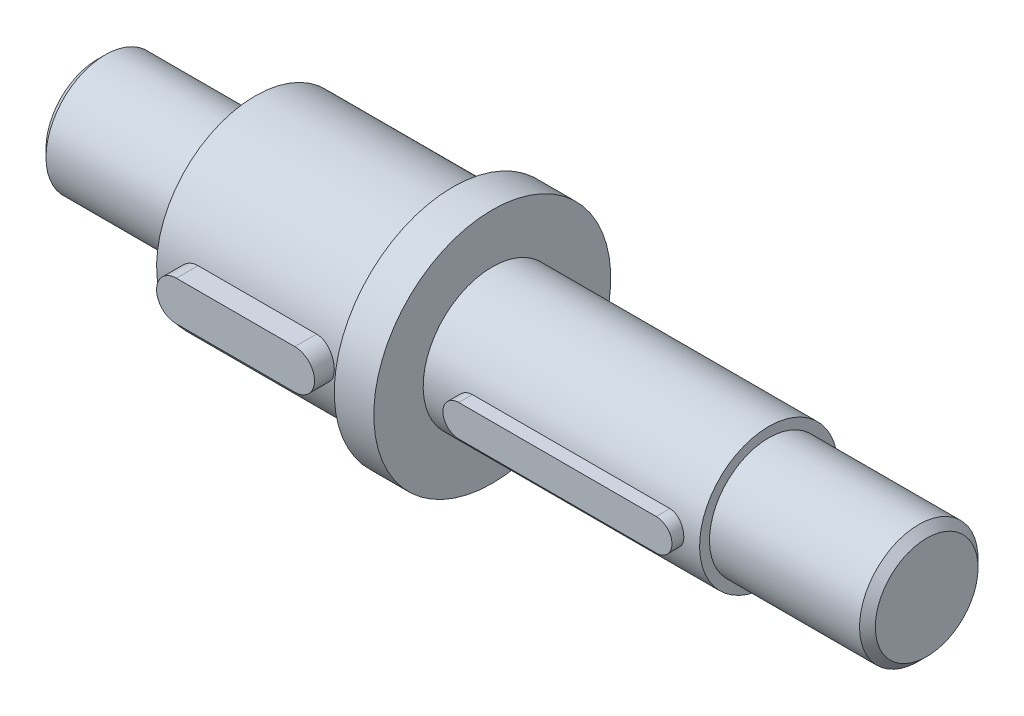
ISO-10303-21;
HEADER;
FILE_DESCRIPTION(('STEP AP214'),'2;1');
FILE_NAME('part.step','',(''),(''),'','','');
FILE_SCHEMA(('AUTOMOTIVE_DESIGN { 1 0 10303 214 1 1 1 1 }'));
ENDSEC;
DATA;
#1=APPLICATION_CONTEXT('core data for automotive mechanical design processes');
#2=APPLICATION_PROTOCOL_DEFINITION('international standard','automotive_design',2000,#1);
#3=PRODUCT_CONTEXT('',#1,'mechanical');
#4=PRODUCT('Part','Part','',(#3));
#5=PRODUCT_RELATED_PRODUCT_CATEGORY('part','',(#4));
#6=PRODUCT_DEFINITION_FORMATION('','',#4);
#7=PRODUCT_DEFINITION_CONTEXT('part definition',#1,'design');
#8=PRODUCT_DEFINITION('design','',#6,#7);
#9=PRODUCT_DEFINITION_SHAPE('','',#8);
#10=(LENGTH_UNIT() NAMED_UNIT(*) SI_UNIT(.MILLI.,.METRE.));
#11=(NAMED_UNIT(*) PLANE_ANGLE_UNIT() SI_UNIT($,.RADIAN.));
#12=(NAMED_UNIT(*) SI_UNIT($,.STERADIAN.) SOLID_ANGLE_UNIT());
#13=UNCERTAINTY_MEASURE_WITH_UNIT(LENGTH_MEASURE(1.E-05),#10,'distance_accuracy_value','');
#14=(GEOMETRIC_REPRESENTATION_CONTEXT(3) GLOBAL_UNCERTAINTY_ASSIGNED_CONTEXT((#13)) GLOBAL_UNIT_ASSIGNED_CONTEXT((#10,
#11,#12)) REPRESENTATION_CONTEXT('',''));
#15=CARTESIAN_POINT('',(0.,0.,0.));
#16=DIRECTION('',(0.,0.,1.));
#17=DIRECTION('',(1.,0.,0.));
#18=AXIS2_PLACEMENT_3D('',#15,#16,#17);
#19=CARTESIAN_POINT('',(112.,0.,20.5));
#20=DIRECTION('',(0.,0.,-1.));
#21=DIRECTION('',(-1.,0.,0.));
#22=AXIS2_PLACEMENT_3D('',#19,#20,#21);
#23=CYLINDRICAL_SURFACE('',#22,4.);
#24=CARTESIAN_POINT('',(112.,0.,14.5));
#25=DIRECTION('',(0.,0.,1.));
#26=DIRECTION('',(1.,0.,0.));
#27=AXIS2_PLACEMENT_3D('',#24,#25,#26);
#28=CIRCLE('',#27,4.);
#29=CARTESIAN_POINT('',(112.,4.,14.5));
#30=VERTEX_POINT('',#29);
#31=CARTESIAN_POINT('',(112.,-4.,14.5));
#32=VERTEX_POINT('',#31);
#33=EDGE_CURVE('E120',#30,#32,#28,.T.);
#34=ORIENTED_EDGE('',*,*,#33,.T.);
#35=DIRECTION('',(0.,0.,-1.));
#36=VECTOR('',#35,1.);
#37=CARTESIAN_POINT('',(112.,-4.,20.5));
#38=LINE('',#37,#36);
#39=CARTESIAN_POINT('',(112.,-4.,20.5));
#40=VERTEX_POINT('',#39);
#41=EDGE_CURVE('E12',#40,#32,#38,.T.);
#42=ORIENTED_EDGE('',*,*,#41,.F.);
#43=CARTESIAN_POINT('',(112.,0.,20.5));
#44=DIRECTION('',(0.,0.,1.));
#45=DIRECTION('',(1.,0.,0.));
#46=AXIS2_PLACEMENT_3D('',#43,#44,#45);
#47=CIRCLE('',#46,4.);
#48=CARTESIAN_POINT('',(112.,4.,20.5));
#49=VERTEX_POINT('',#48);
#50=EDGE_CURVE('E108',#49,#40,#47,.T.);
#51=ORIENTED_EDGE('',*,*,#50,.F.);
#52=DIRECTION('',(0.,0.,-1.));
#53=VECTOR('',#52,1.);
#54=CARTESIAN_POINT('',(112.,4.,20.5));
#55=LINE('',#54,#53);
#56=EDGE_CURVE('E116',#49,#30,#55,.T.);
#57=ORIENTED_EDGE('',*,*,#56,.T.);
#58=EDGE_LOOP('',(#34,#42,#51,#57));
#59=FACE_BOUND('',#58,.T.);
#60=ADVANCED_FACE('F57',(#59),#23,.T.);
#61=CARTESIAN_POINT('',(112.,-4.,20.5));
#62=DIRECTION('',(0.,1.,0.));
#63=DIRECTION('',(0.,0.,1.));
#64=AXIS2_PLACEMENT_3D('',#61,#62,#63);
#65=PLANE('',#64);
#66=DIRECTION('',(1.,0.,0.));
#67=VECTOR('',#66,1.);
#68=CARTESIAN_POINT('',(112.,-4.,14.5));
#69=LINE('',#68,#67);
#70=CARTESIAN_POINT('',(162.,-4.,14.5));
#71=VERTEX_POINT('',#70);
#72=EDGE_CURVE('E112',#32,#71,#69,.T.);
#73=ORIENTED_EDGE('',*,*,#72,.T.);
#74=DIRECTION('',(0.,0.,-1.));
#75=VECTOR('',#74,1.);
#76=CARTESIAN_POINT('',(162.,-4.,20.5));
#77=LINE('',#76,#75);
#78=CARTESIAN_POINT('',(162.,-4.,20.5));
#79=VERTEX_POINT('',#78);
#80=EDGE_CURVE('E65',#79,#71,#77,.T.);
#81=ORIENTED_EDGE('',*,*,#80,.F.);
#82=DIRECTION('',(1.,0.,0.));
#83=VECTOR('',#82,1.);
#84=CARTESIAN_POINT('',(112.,-4.,20.5));
#85=LINE('',#84,#83);
#86=EDGE_CURVE('E103',#40,#79,#85,.T.);
#87=ORIENTED_EDGE('',*,*,#86,.F.);
#88=ORIENTED_EDGE('',*,*,#41,.T.);
#89=EDGE_LOOP('',(#73,#81,#87,#88));
#90=FACE_BOUND('',#89,.T.);
#91=ADVANCED_FACE('F111',(#90),#65,.F.);
#92=CARTESIAN_POINT('',(162.,0.,20.5));
#93=DIRECTION('',(0.,0.,-1.));
#94=DIRECTION('',(-1.,0.,0.));
#95=AXIS2_PLACEMENT_3D('',#92,#93,#94);
#96=CYLINDRICAL_SURFACE('',#95,4.);
#97=CARTESIAN_POINT('',(162.,0.,14.5));
#98=DIRECTION('',(0.,0.,1.));
#99=DIRECTION('',(1.,0.,0.));
#100=AXIS2_PLACEMENT_3D('',#97,#98,#99);
#101=CIRCLE('',#100,4.);
#102=CARTESIAN_POINT('',(162.,4.,14.5));
#103=VERTEX_POINT('',#102);
#104=EDGE_CURVE('E90',#71,#103,#101,.T.);
#105=ORIENTED_EDGE('',*,*,#104,.T.);
#106=DIRECTION('',(0.,0.,-1.));
#107=VECTOR('',#106,1.);
#108=CARTESIAN_POINT('',(162.,4.,20.5));
#109=LINE('',#108,#107);
#110=CARTESIAN_POINT('',(162.,4.,20.5));
#111=VERTEX_POINT('',#110);
#112=EDGE_CURVE('E113',#111,#103,#109,.T.);
#113=ORIENTED_EDGE('',*,*,#112,.F.);
#114=CARTESIAN_POINT('',(162.,0.,20.5));
#115=DIRECTION('',(0.,0.,1.));
#116=DIRECTION('',(1.,0.,0.));
#117=AXIS2_PLACEMENT_3D('',#114,#115,#116);
#118=CIRCLE('',#117,4.);
#119=EDGE_CURVE('E106',#79,#111,#118,.T.);
#120=ORIENTED_EDGE('',*,*,#119,.F.);
#121=ORIENTED_EDGE('',*,*,#80,.T.);
#122=EDGE_LOOP('',(#105,#113,#120,#121));
#123=FACE_BOUND('',#122,.T.);
#124=ADVANCED_FACE('F114',(#123),#96,.T.);
#125=CARTESIAN_POINT('',(162.,4.,20.5));
#126=DIRECTION('',(0.,-1.,0.));
#127=DIRECTION('',(0.,0.,-1.));
#128=AXIS2_PLACEMENT_3D('',#125,#126,#127);
#129=PLANE('',#128);
#130=DIRECTION('',(-1.,0.,0.));
#131=VECTOR('',#130,1.);
#132=CARTESIAN_POINT('',(162.,4.,14.5));
#133=LINE('',#132,#131);
#134=EDGE_CURVE('E96',#103,#30,#133,.T.);
#135=ORIENTED_EDGE('',*,*,#134,.T.);
#136=ORIENTED_EDGE('',*,*,#56,.F.);
#137=DIRECTION('',(-1.,0.,0.));
#138=VECTOR('',#137,1.);
#139=CARTESIAN_POINT('',(162.,4.,20.5));
#140=LINE('',#139,#138);
#141=EDGE_CURVE('E73',#111,#49,#140,.T.);
#142=ORIENTED_EDGE('',*,*,#141,.F.);
#143=ORIENTED_EDGE('',*,*,#112,.T.);
#144=EDGE_LOOP('',(#135,#136,#142,#143));
#145=FACE_BOUND('',#144,.T.);
#146=ADVANCED_FACE('F127',(#145),#129,.F.);
#147=CARTESIAN_POINT('',(112.,0.,20.5));
#148=DIRECTION('',(0.,0.,1.));
#149=DIRECTION('',(1.,0.,0.));
#150=AXIS2_PLACEMENT_3D('',#147,#148,#149);
#151=PLANE('',#150);
#152=ORIENTED_EDGE('',*,*,#50,.T.);
#153=ORIENTED_EDGE('',*,*,#86,.T.);
#154=ORIENTED_EDGE('',*,*,#119,.T.);
#155=ORIENTED_EDGE('',*,*,#141,.T.);
#156=EDGE_LOOP('',(#152,#153,#154,#155));
#157=FACE_BOUND('',#156,.T.);
#158=ADVANCED_FACE('F104',(#157),#151,.T.);
#159=CARTESIAN_POINT('',(112.,0.,14.5));
#160=DIRECTION('',(0.,0.,1.));
#161=DIRECTION('',(1.,0.,0.));
#162=AXIS2_PLACEMENT_3D('',#159,#160,#161);
#163=PLANE('',#162);
#164=ORIENTED_EDGE('',*,*,#33,.F.);
#165=ORIENTED_EDGE('',*,*,#134,.F.);
#166=ORIENTED_EDGE('',*,*,#104,.F.);
#167=ORIENTED_EDGE('',*,*,#72,.F.);
#168=EDGE_LOOP('',(#164,#165,#166,#167));
#169=FACE_BOUND('',#168,.T.);
#170=ADVANCED_FACE('F130',(#169),#163,.F.);
#171=CLOSED_SHELL('',(#60,#91,#124,#146,#158,#170));
#172=MANIFOLD_SOLID_BREP('B2',#171);
#173=CARTESIAN_POINT('',(0.,0.,0.));
#174=DIRECTION('',(-1.,0.,0.));
#175=DIRECTION('',(0.,-1.,0.));
#176=AXIS2_PLACEMENT_3D('',#173,#174,#175);
#177=PLANE('',#176);
#178=CARTESIAN_POINT('',(0.,0.,0.));
#179=DIRECTION('',(-1.,0.,0.));
#180=DIRECTION('',(0.,-1.,0.));
#181=AXIS2_PLACEMENT_3D('',#178,#179,#180);
#182=CIRCLE('',#181,13.);
#183=CARTESIAN_POINT('',(0.,-13.,0.));
#184=VERTEX_POINT('',#183);
#185=EDGE_CURVE('E358',#184,#184,#182,.T.);
#186=ORIENTED_EDGE('',*,*,#185,.T.);
#187=EDGE_LOOP('',(#186));
#188=FACE_BOUND('',#187,.T.);
#189=ADVANCED_FACE('F193',(#188),#177,.T.);
#190=CARTESIAN_POINT('',(210.,0.,0.));
#191=DIRECTION('',(1.,0.,0.));
#192=DIRECTION('',(0.,1.,0.));
#193=AXIS2_PLACEMENT_3D('',#190,#191,#192);
#194=CYLINDRICAL_SURFACE('',#193,15.);
#195=CARTESIAN_POINT('',(1.99999999999997,0.,0.));
#196=DIRECTION('',(-1.,0.,0.));
#197=DIRECTION('',(0.,-1.,0.));
#198=AXIS2_PLACEMENT_3D('',#195,#196,#197);
#199=CIRCLE('',#198,15.);
#200=CARTESIAN_POINT('',(1.99999999999997,-15.,0.));
#201=VERTEX_POINT('',#200);
#202=EDGE_CURVE('E354',#201,#201,#199,.F.);
#203=ORIENTED_EDGE('',*,*,#202,.T.);
#204=EDGE_LOOP('',(#203));
#205=FACE_BOUND('',#204,.T.);
#206=CARTESIAN_POINT('',(40.,0.,0.));
#207=DIRECTION('',(1.,0.,0.));
#208=DIRECTION('',(0.,1.,0.));
#209=AXIS2_PLACEMENT_3D('',#206,#207,#208);
#210=CIRCLE('',#209,15.);
#211=CARTESIAN_POINT('',(40.,15.,0.));
#212=VERTEX_POINT('',#211);
#213=EDGE_CURVE('E350',#212,#212,#210,.T.);
#214=ORIENTED_EDGE('',*,*,#213,.F.);
#215=EDGE_LOOP('',(#214));
#216=FACE_BOUND('',#215,.T.);
#217=ADVANCED_FACE('F464',(#205,#216),#194,.T.);
#218=CARTESIAN_POINT('',(40.,15.,0.));
#219=DIRECTION('',(-1.,0.,0.));
#220=DIRECTION('',(0.,-1.,0.));
#221=AXIS2_PLACEMENT_3D('',#218,#219,#220);
#222=PLANE('',#221);
#223=ORIENTED_EDGE('',*,*,#213,.T.);
#224=EDGE_LOOP('',(#223));
#225=FACE_BOUND('',#224,.T.);
#226=CARTESIAN_POINT('',(40.,0.,0.));
#227=DIRECTION('',(1.,0.,0.));
#228=DIRECTION('',(0.,1.,0.));
#229=AXIS2_PLACEMENT_3D('',#226,#227,#228);
#230=CIRCLE('',#229,25.);
#231=CARTESIAN_POINT('',(40.,25.,0.));
#232=VERTEX_POINT('',#231);
#233=EDGE_CURVE('E346',#232,#232,#230,.T.);
#234=ORIENTED_EDGE('',*,*,#233,.F.);
#235=EDGE_LOOP('',(#234));
#236=FACE_BOUND('',#235,.T.);
#237=ADVANCED_FACE('F470',(#225,#236),#222,.T.);
#238=CARTESIAN_POINT('',(210.,0.,0.));
#239=DIRECTION('',(1.,0.,0.));
#240=DIRECTION('',(0.,1.,0.));
#241=AXIS2_PLACEMENT_3D('',#238,#239,#240);
#242=CYLINDRICAL_SURFACE('',#241,25.);
#243=CARTESIAN_POINT('',(80.,-4.99999999999999,24.4948974278318));
#244=CARTESIAN_POINT('',(80.1391253266414,-5.00001666827264,24.4948849644864));
#245=CARTESIAN_POINT('',(80.2782463400245,-4.99419397242176,24.4960823045703));
#246=CARTESIAN_POINT('',(80.5554648435272,-4.97099170943313,24.50080611049));
#247=CARTESIAN_POINT('',(80.6935624581255,-4.95361357194362,24.5043322881998));
#248=CARTESIAN_POINT('',(80.9675458103971,-4.90745732970079,24.513616269194));
#249=CARTESIAN_POINT('',(81.1034345908507,-4.87869659169541,24.5193706725256));
#250=CARTESIAN_POINT('',(81.3722534051872,-4.81000656952587,24.5329384582686));
#251=CARTESIAN_POINT('',(81.5051834269892,-4.77007723976851,24.5407518490854));
#252=CARTESIAN_POINT('',(81.7671454567224,-4.67935997504847,24.5582108316482));
#253=CARTESIAN_POINT('',(81.8961778299596,-4.62857306133625,24.5678562510663));
#254=CARTESIAN_POINT('',(82.1495228220018,-4.5164969896502,24.5887068281803));
#255=CARTESIAN_POINT('',(82.2738336734668,-4.45520394548309,24.5999125627442));
#256=CARTESIAN_POINT('',(82.5168156612067,-4.32259070656746,24.6235607101597));
#257=CARTESIAN_POINT('',(82.6354883905463,-4.25127336702452,24.6360027705756));
#258=CARTESIAN_POINT('',(82.86648984474,-4.09907006911225,24.6617838379427));
#259=CARTESIAN_POINT('',(82.9788161769435,-4.01818053703546,24.6751231790797));
#260=CARTESIAN_POINT('',(83.1976679526694,-3.84636310105368,24.7024927456793));
#261=CARTESIAN_POINT('',(83.3041059155987,-3.75532477701367,24.7165294141223));
#262=CARTESIAN_POINT('',(83.5090005646721,-3.56461921808491,24.7447526144403));
#263=CARTESIAN_POINT('',(83.6074542781927,-3.46494879767303,24.7589391999292));
#264=CARTESIAN_POINT('',(83.7956503618845,-3.25770259068246,24.7870592087541));
#265=CARTESIAN_POINT('',(83.8853945639721,-3.15012847492922,24.8009926848246));
#266=CARTESIAN_POINT('',(84.0556088733399,-2.92773828992183,24.8282278973015));
#267=CARTESIAN_POINT('',(84.1360755503133,-2.81291956614297,24.8415293989775));
#268=CARTESIAN_POINT('',(84.2877613382002,-2.57586261860518,24.8672326807152));
#269=CARTESIAN_POINT('',(84.3588975606977,-2.45357041583781,24.8796260142365));
#270=CARTESIAN_POINT('',(84.4906250198366,-2.20324717771264,24.9030421535278));
#271=CARTESIAN_POINT('',(84.5512123017208,-2.07521401261381,24.9140644448591));
#272=CARTESIAN_POINT('',(84.6613208436174,-1.81441746775922,24.9344136360483));
#273=CARTESIAN_POINT('',(84.7108475984345,-1.68165647494044,24.9437413773172));
#274=CARTESIAN_POINT('',(84.7985020176939,-1.41225203764252,24.9604441197165));
#275=CARTESIAN_POINT('',(84.8366255558689,-1.27560720732983,24.9678184138796));
#276=CARTESIAN_POINT('',(84.9007026495545,-1.0013301067078,24.9803102866208));
#277=CARTESIAN_POINT('',(84.9268137751062,-0.863736164157331,24.9854570281343));
#278=CARTESIAN_POINT('',(84.9674264931271,-0.586784276733812,24.9934984482444));
#279=CARTESIAN_POINT('',(84.9819240548557,-0.447425736450269,24.9963923449322));
#280=CARTESIAN_POINT('',(85.007722093994,-0.028233914543985,25.0015345303172));
#281=CARTESIAN_POINT('',(85.0014024880644,0.253035346754799,25.0002582152219));
#282=CARTESIAN_POINT('',(84.9570342009316,0.668581641108652,24.9914408151569));
#283=CARTESIAN_POINT('',(84.9366814465339,0.805138662755828,24.9874010387134));
#284=CARTESIAN_POINT('',(84.8847845695753,1.07603260238649,24.9771983765684));
#285=CARTESIAN_POINT('',(84.8532443393329,1.21037027552905,24.9710362292986));
#286=CARTESIAN_POINT('',(84.7791934341752,1.47591760067315,24.9567501974578));
#287=CARTESIAN_POINT('',(84.7366787586714,1.60712609287945,24.9486255975703));
#288=CARTESIAN_POINT('',(84.6410233920703,1.8654381437386,24.9306416146559));
#289=CARTESIAN_POINT('',(84.5878863834583,1.99254310728992,24.9207828329663));
#290=CARTESIAN_POINT('',(84.4709762706757,2.2426674277943,24.899524196117));
#291=CARTESIAN_POINT('',(84.4071346269613,2.36565390182105,24.8881145061704));
#292=CARTESIAN_POINT('',(84.2695501862382,2.6057785531881,24.8641202109373));
#293=CARTESIAN_POINT('',(84.1958108496162,2.72291875492853,24.851536016742));
#294=CARTESIAN_POINT('',(84.0388948841914,2.95067106820489,24.8255248721503));
#295=CARTESIAN_POINT('',(83.9557142996826,3.06128041370931,24.8120975695679));
#296=CARTESIAN_POINT('',(83.7805378509762,3.27515412500652,24.7847732726215));
#297=CARTESIAN_POINT('',(83.6885450703313,3.3784210381766,24.7708764436475));
#298=CARTESIAN_POINT('',(83.4946284635822,3.57873527346884,24.7427376365477));
#299=CARTESIAN_POINT('',(83.3925576496267,3.67564011377472,24.7284939036525));
#300=CARTESIAN_POINT('',(83.1806275854925,3.86048859181167,24.7003111004447));
#301=CARTESIAN_POINT('',(83.0707711471919,3.94843543715,24.6863719224938));
#302=CARTESIAN_POINT('',(82.843906189763,4.11485123813351,24.6591791231742));
#303=CARTESIAN_POINT('',(82.7268930120297,4.19331391911306,24.6459259589468));
#304=CARTESIAN_POINT('',(82.4866232792524,4.34010555279845,24.6205002572596));
#305=CARTESIAN_POINT('',(82.3633691261763,4.40843836501602,24.6083273089475));
#306=CARTESIAN_POINT('',(82.1110335271011,4.53469984736732,24.5853743099635));
#307=CARTESIAN_POINT('',(81.981935173049,4.59259554826929,24.5745987023543));
#308=CARTESIAN_POINT('',(81.719229383387,4.69725810665846,24.5548081643222));
#309=CARTESIAN_POINT('',(81.5856237328049,4.74402931205847,24.5457925462705));
#310=CARTESIAN_POINT('',(81.3149597529441,4.82606031456236,24.5297959324801));
#311=CARTESIAN_POINT('',(81.1779051839507,4.86133210938725,24.5228128169847));
#312=CARTESIAN_POINT('',(80.9012624710491,4.92013311165956,24.5110829912476));
#313=CARTESIAN_POINT('',(80.7616755648169,4.943667903404,24.5063352175227));
#314=CARTESIAN_POINT('',(80.5182407981625,4.97415554156175,24.5001622999759));
#315=CARTESIAN_POINT('',(80.4147417318496,4.9838517075934,24.498189711568));
#316=CARTESIAN_POINT('',(80.2074982694361,4.99677038633665,24.4955566519276));
#317=CARTESIAN_POINT('',(80.1037545762686,5.00000373289603,24.4948939848492));
#318=CARTESIAN_POINT('',(80.,5.00000000000001,24.4948974278318));
#319=B_SPLINE_CURVE_WITH_KNOTS('',3,(#243,#244,#245,#246,#247,#248,#249,#250,#251,#252,#253,
#254,#255,#256,#257,#258,#259,#260,#261,#262,#263,#264,#265,#266,#267,#268,#269,#270,#271,#272,
#273,#274,#275,#276,#277,#278,#279,#280,#281,#282,#283,#284,#285,#286,#287,#288,#289,#290,#291,
#292,#293,#294,#295,#296,#297,#298,#299,#300,#301,#302,#303,#304,#305,#306,#307,#308,#309,#310,
#311,#312,#313,#314,#315,#316,#317,#318),.UNSPECIFIED.,.F.,.F.,(4,2,2,2,2,2,2,2,2,2,2,2,2,2,2,2,
2,2,2,2,2,2,2,2,2,2,2,2,2,2,2,2,2,2,2,2,2,4),(0.,0.417242551789585,0.834433491607664,
1.25099035047395,1.6675489098622,2.08406830550986,2.50074210451559,2.91729746251713,
3.33400883196915,3.75580364592259,4.17775478454161,4.59961697876816,5.02163465704724,
5.44717860948246,5.87288175479562,6.29837294048706,6.72401790492143,7.14390813062633,
7.56394402533168,8.40304192223055,8.81705081972049,9.2309158173335,9.64493189752779,
10.0588046972975,10.4754363941303,10.8919228076445,11.3085843698369,11.7251006632377,
12.1489910901878,12.5727291962766,12.9967461280637,13.4206010905545,13.8457723408149,
14.2707771424992,14.6953370927157,15.1196948502476,15.4314077968161,15.7425977684821),.UNSPECIFIED.);
#320=CARTESIAN_POINT('',(80.,-4.99999999999999,24.4948974278318));
#321=VERTEX_POINT('',#320);
#322=CARTESIAN_POINT('',(80.,5.00000000000001,24.4948974278318));
#323=VERTEX_POINT('',#322);
#324=EDGE_CURVE('E413',#321,#323,#319,.T.);
#325=ORIENTED_EDGE('',*,*,#324,.F.);
#326=DIRECTION('',(1.,0.,0.));
#327=VECTOR('',#326,1.);
#328=CARTESIAN_POINT('',(210.,-4.99999999999999,24.4948974278318));
#329=LINE('',#328,#327);
#330=CARTESIAN_POINT('',(50.,-5.,24.4948974278318));
#331=VERTEX_POINT('',#330);
#332=EDGE_CURVE('E55',#331,#321,#329,.T.);
#333=ORIENTED_EDGE('',*,*,#332,.F.);
#334=CARTESIAN_POINT('',(50.,5.,24.4948974278318));
#335=CARTESIAN_POINT('',(49.8608746733586,5.00001666827265,24.4948849644864));
#336=CARTESIAN_POINT('',(49.7217536599755,4.99419397242177,24.4960823045703));
#337=CARTESIAN_POINT('',(49.4445351564728,4.97099170943313,24.50080611049));
#338=CARTESIAN_POINT('',(49.3064375418745,4.95361357194363,24.5043322881998));
#339=CARTESIAN_POINT('',(49.032454189603,4.9074573297008,24.513616269194));
#340=CARTESIAN_POINT('',(48.8965654091493,4.87869659169542,24.5193706725256));
#341=CARTESIAN_POINT('',(48.6277465948128,4.81000656952587,24.5329384582686));
#342=CARTESIAN_POINT('',(48.4948165730109,4.77007723976852,24.5407518490854));
#343=CARTESIAN_POINT('',(48.2328545432777,4.67935997504848,24.5582108316482));
#344=CARTESIAN_POINT('',(48.1038221700404,4.62857306133625,24.5678562510663));
#345=CARTESIAN_POINT('',(47.8504771779982,4.5164969896502,24.5887068281803));
#346=CARTESIAN_POINT('',(47.7261663265332,4.45520394548308,24.5999125627442));
#347=CARTESIAN_POINT('',(47.4831843387933,4.32259070656745,24.6235607101597));
#348=CARTESIAN_POINT('',(47.3645116094537,4.25127336702451,24.6360027705756));
#349=CARTESIAN_POINT('',(47.13351015526,4.09907006911224,24.6617838379427));
#350=CARTESIAN_POINT('',(47.0211838230565,4.01818053703546,24.6751231790797));
#351=CARTESIAN_POINT('',(46.8023320473307,3.84636310105368,24.7024927456793));
#352=CARTESIAN_POINT('',(46.6958940844013,3.75532477701366,24.7165294141223));
#353=CARTESIAN_POINT('',(46.490999435328,3.56461921808491,24.7447526144403));
#354=CARTESIAN_POINT('',(46.3925457218073,3.46494879767303,24.7589391999292));
#355=CARTESIAN_POINT('',(46.2043496381155,3.25770259068246,24.7870592087541));
#356=CARTESIAN_POINT('',(46.1146054360279,3.15012847492922,24.8009926848246));
#357=CARTESIAN_POINT('',(45.9443911266601,2.92773828992183,24.8282278973015));
#358=CARTESIAN_POINT('',(45.8639244496867,2.81291956614297,24.8415293989775));
#359=CARTESIAN_POINT('',(45.7122386617998,2.57586261860519,24.8672326807152));
#360=CARTESIAN_POINT('',(45.6411024393023,2.45357041583781,24.8796260142365));
#361=CARTESIAN_POINT('',(45.5093749801634,2.20324717771265,24.9030421535278));
#362=CARTESIAN_POINT('',(45.4487876982792,2.07521401261382,24.9140644448591));
#363=CARTESIAN_POINT('',(45.3386791563826,1.81441746775922,24.9344136360483));
#364=CARTESIAN_POINT('',(45.2891524015655,1.68165647494044,24.9437413773172));
#365=CARTESIAN_POINT('',(45.2014979823061,1.41225203764252,24.9604441197165));
#366=CARTESIAN_POINT('',(45.1633744441311,1.27560720732983,24.9678184138796));
#367=CARTESIAN_POINT('',(45.0992973504456,1.00133010670781,24.9803102866208));
#368=CARTESIAN_POINT('',(45.0731862248939,0.86373616415734,24.9854570281343));
#369=CARTESIAN_POINT('',(45.0325735068729,0.586784276733818,24.9934984482444));
#370=CARTESIAN_POINT('',(45.0180759451443,0.447425736450275,24.9963923449322));
#371=CARTESIAN_POINT('',(44.992277906006,0.0282339145439889,25.0015345303172));
#372=CARTESIAN_POINT('',(44.9985975119357,-0.253035346754796,25.0002582152219));
#373=CARTESIAN_POINT('',(45.0429657990685,-0.668581641108654,24.9914408151569));
#374=CARTESIAN_POINT('',(45.0633185534662,-0.805138662755831,24.9874010387134));
#375=CARTESIAN_POINT('',(45.1152154304247,-1.0760326023865,24.9771983765684));
#376=CARTESIAN_POINT('',(45.1467556606671,-1.21037027552906,24.9710362292986));
#377=CARTESIAN_POINT('',(45.2208065658248,-1.47591760067315,24.9567501974578));
#378=CARTESIAN_POINT('',(45.2633212413286,-1.60712609287945,24.9486255975703));
#379=CARTESIAN_POINT('',(45.3589766079297,-1.86543814373861,24.9306416146559));
#380=CARTESIAN_POINT('',(45.4121136165417,-1.99254310728992,24.9207828329663));
#381=CARTESIAN_POINT('',(45.5290237293243,-2.2426674277943,24.899524196117));
#382=CARTESIAN_POINT('',(45.5928653730387,-2.36565390182104,24.8881145061704));
#383=CARTESIAN_POINT('',(45.7304498137618,-2.60577855318809,24.8641202109373));
#384=CARTESIAN_POINT('',(45.8041891503839,-2.72291875492852,24.851536016742));
#385=CARTESIAN_POINT('',(45.9611051158086,-2.95067106820487,24.8255248721503));
#386=CARTESIAN_POINT('',(46.0442857003174,-3.06128041370929,24.8120975695679));
#387=CARTESIAN_POINT('',(46.2194621490239,-3.27515412500651,24.7847732726215));
#388=CARTESIAN_POINT('',(46.3114549296687,-3.37842103817659,24.7708764436475));
#389=CARTESIAN_POINT('',(46.5053715364178,-3.57873527346883,24.7427376365477));
#390=CARTESIAN_POINT('',(46.6074423503734,-3.67564011377471,24.7284939036525));
#391=CARTESIAN_POINT('',(46.8193724145075,-3.86048859181167,24.7003111004447));
#392=CARTESIAN_POINT('',(46.9292288528081,-3.94843543714999,24.6863719224938));
#393=CARTESIAN_POINT('',(47.156093810237,-4.1148512381335,24.6591791231742));
#394=CARTESIAN_POINT('',(47.2731069879703,-4.19331391911305,24.6459259589468));
#395=CARTESIAN_POINT('',(47.5133767207477,-4.34010555279843,24.6205002572596));
#396=CARTESIAN_POINT('',(47.6366308738237,-4.40843836501602,24.6083273089475));
#397=CARTESIAN_POINT('',(47.888966472899,-4.53469984736732,24.5853743099635));
#398=CARTESIAN_POINT('',(48.018064826951,-4.59259554826928,24.5745987023543));
#399=CARTESIAN_POINT('',(48.280770616613,-4.69725810665845,24.5548081643222));
#400=CARTESIAN_POINT('',(48.4143762671951,-4.74402931205847,24.5457925462705));
#401=CARTESIAN_POINT('',(48.6850402470559,-4.82606031456236,24.5297959324801));
#402=CARTESIAN_POINT('',(48.8220948160494,-4.86133210938725,24.5228128169847));
#403=CARTESIAN_POINT('',(49.0987375289509,-4.92013311165956,24.5110829912476));
#404=CARTESIAN_POINT('',(49.2383244351832,-4.94366790340399,24.5063352175227));
#405=CARTESIAN_POINT('',(49.4817592018376,-4.97415554156174,24.500162299976));
#406=CARTESIAN_POINT('',(49.5852582681504,-4.98385170759339,24.498189711568));
#407=CARTESIAN_POINT('',(49.7925017305639,-4.99677038633664,24.4955566519276));
#408=CARTESIAN_POINT('',(49.8962454237314,-5.00000373289602,24.4948939848492));
#409=CARTESIAN_POINT('',(50.,-5.,24.4948974278318));
#410=B_SPLINE_CURVE_WITH_KNOTS('',3,(#334,#335,#336,#337,#338,#339,#340,#341,#342,#343,#344,
#345,#346,#347,#348,#349,#350,#351,#352,#353,#354,#355,#356,#357,#358,#359,#360,#361,#362,#363,
#364,#365,#366,#367,#368,#369,#370,#371,#372,#373,#374,#375,#376,#377,#378,#379,#380,#381,#382,
#383,#384,#385,#386,#387,#388,#389,#390,#391,#392,#393,#394,#395,#396,#397,#398,#399,#400,#401,
#402,#403,#404,#405,#406,#407,#408,#409),.UNSPECIFIED.,.F.,.F.,(4,2,2,2,2,2,2,2,2,2,2,2,2,2,2,2,
2,2,2,2,2,2,2,2,2,2,2,2,2,2,2,2,2,2,2,2,2,4),(0.,0.417242551789599,0.834433491607671,
1.25099035047396,1.66754890986221,2.08406830550986,2.50074210451562,2.91729746251716,
3.33400883196916,3.75580364592261,4.17775478454161,4.59961697876817,5.02163465704724,
5.44717860948246,5.87288175479562,6.29837294048707,6.72401790492142,7.14390813062632,
7.56394402533168,8.40304192223056,8.8170508197205,9.23091581733351,9.6449318975278,
10.0588046972975,10.4754363941303,10.8919228076445,11.3085843698369,11.7251006632377,
12.1489910901879,12.5727291962766,12.9967461280637,13.4206010905545,13.8457723408149,
14.2707771424992,14.6953370927157,15.1196948502477,15.4314077968161,15.7425977684821),.UNSPECIFIED.);
#411=CARTESIAN_POINT('',(50.,5.,24.4948974278318));
#412=VERTEX_POINT('',#411);
#413=EDGE_CURVE('E203',#412,#331,#410,.T.);
#414=ORIENTED_EDGE('',*,*,#413,.F.);
#415=DIRECTION('',(1.,0.,0.));
#416=VECTOR('',#415,1.);
#417=CARTESIAN_POINT('',(210.,5.00000000000001,24.4948974278318));
#418=LINE('',#417,#416);
#419=EDGE_CURVE('E423',#412,#323,#418,.T.);
#420=ORIENTED_EDGE('',*,*,#419,.T.);
#421=EDGE_LOOP('',(#325,#333,#414,#420));
#422=FACE_BOUND('',#421,.T.);
#423=ORIENTED_EDGE('',*,*,#233,.T.);
#424=EDGE_LOOP('',(#423));
#425=FACE_BOUND('',#424,.T.);
#426=CARTESIAN_POINT('',(90.,0.,0.));
#427=DIRECTION('',(1.,0.,0.));
#428=DIRECTION('',(0.,1.,0.));
#429=AXIS2_PLACEMENT_3D('',#426,#427,#428);
#430=CIRCLE('',#429,25.);
#431=CARTESIAN_POINT('',(90.,25.,0.));
#432=VERTEX_POINT('',#431);
#433=EDGE_CURVE('E342',#432,#432,#430,.T.);
#434=ORIENTED_EDGE('',*,*,#433,.F.);
#435=EDGE_LOOP('',(#434));
#436=FACE_BOUND('',#435,.T.);
#437=ADVANCED_FACE('F424',(#422,#425,#436),#242,.T.);
#438=CARTESIAN_POINT('',(90.,25.,0.));
#439=DIRECTION('',(-1.,0.,0.));
#440=DIRECTION('',(0.,-1.,0.));
#441=AXIS2_PLACEMENT_3D('',#438,#439,#440);
#442=PLANE('',#441);
#443=ORIENTED_EDGE('',*,*,#433,.T.);
#444=EDGE_LOOP('',(#443));
#445=FACE_BOUND('',#444,.T.);
#446=CARTESIAN_POINT('',(90.,0.,0.));
#447=DIRECTION('',(1.,0.,0.));
#448=DIRECTION('',(0.,1.,0.));
#449=AXIS2_PLACEMENT_3D('',#446,#447,#448);
#450=CIRCLE('',#449,30.);
#451=CARTESIAN_POINT('',(90.,30.,0.));
#452=VERTEX_POINT('',#451);
#453=EDGE_CURVE('E338',#452,#452,#450,.T.);
#454=ORIENTED_EDGE('',*,*,#453,.F.);
#455=EDGE_LOOP('',(#454));
#456=FACE_BOUND('',#455,.T.);
#457=ADVANCED_FACE('F497',(#445,#456),#442,.T.);
#458=CARTESIAN_POINT('',(210.,0.,0.));
#459=DIRECTION('',(1.,0.,0.));
#460=DIRECTION('',(0.,1.,0.));
#461=AXIS2_PLACEMENT_3D('',#458,#459,#460);
#462=CYLINDRICAL_SURFACE('',#461,30.);
#463=ORIENTED_EDGE('',*,*,#453,.T.);
#464=EDGE_LOOP('',(#463));
#465=FACE_BOUND('',#464,.T.);
#466=CARTESIAN_POINT('',(100.,0.,0.));
#467=DIRECTION('',(1.,0.,0.));
#468=DIRECTION('',(0.,1.,0.));
#469=AXIS2_PLACEMENT_3D('',#466,#467,#468);
#470=CIRCLE('',#469,30.);
#471=CARTESIAN_POINT('',(100.,30.,0.));
#472=VERTEX_POINT('',#471);
#473=EDGE_CURVE('E334',#472,#472,#470,.T.);
#474=ORIENTED_EDGE('',*,*,#473,.F.);
#475=EDGE_LOOP('',(#474));
#476=FACE_BOUND('',#475,.T.);
#477=ADVANCED_FACE('F502',(#465,#476),#462,.T.);
#478=CARTESIAN_POINT('',(100.,30.,0.));
#479=DIRECTION('',(1.,0.,0.));
#480=DIRECTION('',(0.,1.,0.));
#481=AXIS2_PLACEMENT_3D('',#478,#479,#480);
#482=PLANE('',#481);
#483=ORIENTED_EDGE('',*,*,#473,.T.);
#484=EDGE_LOOP('',(#483));
#485=FACE_BOUND('',#484,.T.);
#486=CARTESIAN_POINT('',(100.,0.,0.));
#487=DIRECTION('',(1.,0.,0.));
#488=DIRECTION('',(0.,1.,0.));
#489=AXIS2_PLACEMENT_3D('',#486,#487,#488);
#490=CIRCLE('',#489,17.5);
#491=CARTESIAN_POINT('',(100.,17.5,0.));
#492=VERTEX_POINT('',#491);
#493=EDGE_CURVE('E330',#492,#492,#490,.T.);
#494=ORIENTED_EDGE('',*,*,#493,.F.);
#495=EDGE_LOOP('',(#494));
#496=FACE_BOUND('',#495,.T.);
#497=ADVANCED_FACE('F507',(#485,#496),#482,.T.);
#498=CARTESIAN_POINT('',(210.,0.,0.));
#499=DIRECTION('',(1.,0.,0.));
#500=DIRECTION('',(0.,1.,0.));
#501=AXIS2_PLACEMENT_3D('',#498,#499,#500);
#502=CYLINDRICAL_SURFACE('',#501,17.5);
#503=CARTESIAN_POINT('',(162.,-4.,17.0367250374008));
#504=CARTESIAN_POINT('',(162.11093184902,-4.00001248231752,17.0367138660067));
#505=CARTESIAN_POINT('',(162.221856522959,-3.99538546502867,17.0378082617858));
#506=CARTESIAN_POINT('',(162.442882567238,-3.97694932157873,17.0421253952987));
#507=CARTESIAN_POINT('',(162.552984056812,-3.96314155232038,17.0453478185125));
#508=CARTESIAN_POINT('',(162.771394764874,-3.92647318924765,17.0538307536469));
#509=CARTESIAN_POINT('',(162.879706808203,-3.90362864568808,17.059087651771));
#510=CARTESIAN_POINT('',(163.09394088357,-3.8490944107021,17.0714746819689));
#511=CARTESIAN_POINT('',(163.199862893385,-3.81740463706963,17.0786048314524));
#512=CARTESIAN_POINT('',(163.512935001935,-3.70940007909276,17.1025105269156));
#513=CARTESIAN_POINT('',(163.715589285798,-3.6201165136919,17.1218095761762));
#514=CARTESIAN_POINT('',(164.102981185358,-3.40971418070428,17.1649441397841));
#515=CARTESIAN_POINT('',(164.287715323997,-3.28858925176467,17.1887805318677));
#516=CARTESIAN_POINT('',(164.637506120977,-3.01555269417646,17.2387926899631));
#517=CARTESIAN_POINT('',(164.802189465638,-2.86316778652959,17.2650004661165));
#518=CARTESIAN_POINT('',(165.103899516175,-2.53295238865314,17.3165247611238));
#519=CARTESIAN_POINT('',(165.240921871269,-2.35511790297881,17.3418411392541));
#520=CARTESIAN_POINT('',(165.484920320039,-1.97651609742511,17.3890809668325));
#521=CARTESIAN_POINT('',(165.591531922665,-1.77550809318057,17.410961949179));
#522=CARTESIAN_POINT('',(165.769312917776,-1.35785483515842,17.4484992744045));
#523=CARTESIAN_POINT('',(165.840488491103,-1.14121231594595,17.4641567027156));
#524=CARTESIAN_POINT('',(165.94419498592,-0.702348968435724,17.4872566687127));
#525=CARTESIAN_POINT('',(165.97736391185,-0.480286158684641,17.4948346770719));
#526=CARTESIAN_POINT('',(166.006112658358,-0.0336222528298652,17.5013922359856));
#527=CARTESIAN_POINT('',(166.001696306889,0.190978582456416,17.5003726621791));
#528=CARTESIAN_POINT('',(165.955868949988,0.631926010215034,17.489952340558));
#529=CARTESIAN_POINT('',(165.915146795118,0.848348430712721,17.4807076590668));
#530=CARTESIAN_POINT('',(165.798964034895,1.27120201757732,17.4550549045918));
#531=CARTESIAN_POINT('',(165.723502053284,1.47763278775589,17.4386465478122));
#532=CARTESIAN_POINT('',(165.539389719512,1.87652973429281,17.4002626903077));
#533=CARTESIAN_POINT('',(165.430482640064,2.06887311134545,17.3782443578209));
#534=CARTESIAN_POINT('',(165.182756987986,2.43280009121923,17.3310474587669));
#535=CARTESIAN_POINT('',(165.043934810496,2.60438118822771,17.3058685114887));
#536=CARTESIAN_POINT('',(164.736641865151,2.92598580900956,17.2544419046368));
#537=CARTESIAN_POINT('',(164.567572262424,3.0754348941749,17.2281829516239));
#538=CARTESIAN_POINT('',(164.206334696989,3.34405202485233,17.1780692090276));
#539=CARTESIAN_POINT('',(164.01416044236,3.46321179425783,17.1542150775981));
#540=CARTESIAN_POINT('',(163.712378158844,3.61671597326182,17.1222689727167));
#541=CARTESIAN_POINT('',(163.609249675499,3.66376574815987,17.1122387789592));
#542=CARTESIAN_POINT('',(163.39926179983,3.74898399268379,17.0937715302981));
#543=CARTESIAN_POINT('',(163.292403901572,3.78715597297673,17.0853338458964));
#544=CARTESIAN_POINT('',(163.075832608582,3.85427424858369,17.0703178704533));
#545=CARTESIAN_POINT('',(162.966122301403,3.88323010403837,17.0637376534167));
#546=CARTESIAN_POINT('',(162.744580972851,3.93172314689819,17.0526294698307));
#547=CARTESIAN_POINT('',(162.632750977486,3.95126477595513,17.0481005355421));
#548=CARTESIAN_POINT('',(162.434002925146,3.97733749089981,17.0420340571271));
#549=CARTESIAN_POINT('',(162.347351562686,3.98583914323426,17.0400453891908));
#550=CARTESIAN_POINT('',(162.173802702972,3.99716769798061,17.0373899876291));
#551=CARTESIAN_POINT('',(162.086905849963,4.00000396405785,17.0367210727583));
#552=CARTESIAN_POINT('',(162.,4.,17.0367250374008));
#553=B_SPLINE_CURVE_WITH_KNOTS('',3,(#503,#504,#505,#506,#507,#508,#509,#510,#511,#512,#513,
#514,#515,#516,#517,#518,#519,#520,#521,#522,#523,#524,#525,#526,#527,#528,#529,#530,#531,#532,
#533,#534,#535,#536,#537,#538,#539,#540,#541,#542,#543,#544,#545,#546,#547,#548,#549,#550,#551,
#552),.UNSPECIFIED.,.F.,.F.,(4,2,2,2,2,2,2,2,2,2,2,2,2,2,2,2,2,2,2,2,2,2,2,2,4),(0.,
0.332681247866687,0.665313336820848,0.997357270100399,1.32940428944207,1.99290262989595,
2.65652945292504,3.3310633925055,4.005703346641,4.68811868485082,5.37041495269125,
6.0410817607265,6.71168026410032,7.36981967360706,8.02798515827641,8.69133469760162,
9.35476421731792,10.0331782060872,10.7117773626502,11.0528239514451,11.3937354453644,
11.7342921410368,12.0746880036043,12.3357711604052,12.5964224446493),.UNSPECIFIED.);
#554=CARTESIAN_POINT('',(162.,-4.,17.0367250374008));
#555=VERTEX_POINT('',#554);
#556=CARTESIAN_POINT('',(162.,4.,17.0367250374008));
#557=VERTEX_POINT('',#556);
#558=EDGE_CURVE('E370',#555,#557,#553,.T.);
#559=ORIENTED_EDGE('',*,*,#558,.F.);
#560=DIRECTION('',(1.,0.,0.));
#561=VECTOR('',#560,1.);
#562=CARTESIAN_POINT('',(210.,-4.,17.0367250374008));
#563=LINE('',#562,#561);
#564=CARTESIAN_POINT('',(112.,-4.,17.0367250374008));
#565=VERTEX_POINT('',#564);
#566=EDGE_CURVE('E410',#565,#555,#563,.T.);
#567=ORIENTED_EDGE('',*,*,#566,.F.);
#568=CARTESIAN_POINT('',(112.,4.,17.0367250374008));
#569=CARTESIAN_POINT('',(111.88906815098,4.00001248231752,17.0367138660067));
#570=CARTESIAN_POINT('',(111.778143477041,3.99538546502867,17.0378082617858));
#571=CARTESIAN_POINT('',(111.557117432762,3.97694932157873,17.0421253952987));
#572=CARTESIAN_POINT('',(111.447015943188,3.96314155232038,17.0453478185125));
#573=CARTESIAN_POINT('',(111.228605235126,3.92647318924765,17.0538307536469));
#574=CARTESIAN_POINT('',(111.120293191797,3.90362864568809,17.059087651771));
#575=CARTESIAN_POINT('',(110.90605911643,3.84909441070211,17.0714746819689));
#576=CARTESIAN_POINT('',(110.800137106614,3.81740463706964,17.0786048314524));
#577=CARTESIAN_POINT('',(110.487064998065,3.70940007909276,17.1025105269156));
#578=CARTESIAN_POINT('',(110.284410714202,3.6201165136919,17.1218095761762));
#579=CARTESIAN_POINT('',(109.897018814642,3.40971418070429,17.1649441397841));
#580=CARTESIAN_POINT('',(109.712284676003,3.28858925176469,17.1887805318677));
#581=CARTESIAN_POINT('',(109.362493879023,3.01555269417647,17.2387926899631));
#582=CARTESIAN_POINT('',(109.197810534362,2.8631677865296,17.2650004661165));
#583=CARTESIAN_POINT('',(108.896100483825,2.53295238865314,17.3165247611238));
#584=CARTESIAN_POINT('',(108.759078128731,2.3551179029788,17.3418411392541));
#585=CARTESIAN_POINT('',(108.515079679961,1.97651609742511,17.3890809668325));
#586=CARTESIAN_POINT('',(108.408468077335,1.77550809318057,17.410961949179));
#587=CARTESIAN_POINT('',(108.230687082224,1.35785483515842,17.4484992744045));
#588=CARTESIAN_POINT('',(108.159511508897,1.14121231594595,17.4641567027156));
#589=CARTESIAN_POINT('',(108.05580501408,0.702348968435727,17.4872566687127));
#590=CARTESIAN_POINT('',(108.02263608815,0.480286158684645,17.4948346770719));
#591=CARTESIAN_POINT('',(107.993887341642,0.0336222528298717,17.5013922359856));
#592=CARTESIAN_POINT('',(107.998303693111,-0.190978582456408,17.5003726621791));
#593=CARTESIAN_POINT('',(108.044131050012,-0.631926010215029,17.489952340558));
#594=CARTESIAN_POINT('',(108.084853204881,-0.848348430712719,17.4807076590668));
#595=CARTESIAN_POINT('',(108.201035965105,-1.27120201757732,17.4550549045918));
#596=CARTESIAN_POINT('',(108.276497946716,-1.47763278775589,17.4386465478122));
#597=CARTESIAN_POINT('',(108.460610280488,-1.87652973429281,17.4002626903077));
#598=CARTESIAN_POINT('',(108.569517359936,-2.06887311134544,17.3782443578209));
#599=CARTESIAN_POINT('',(108.817243012014,-2.43280009121923,17.3310474587669));
#600=CARTESIAN_POINT('',(108.956065189504,-2.6043811882277,17.3058685114888));
#601=CARTESIAN_POINT('',(109.263358134849,-2.92598580900956,17.2544419046368));
#602=CARTESIAN_POINT('',(109.432427737576,-3.0754348941749,17.2281829516239));
#603=CARTESIAN_POINT('',(109.793665303011,-3.34405202485233,17.1780692090276));
#604=CARTESIAN_POINT('',(109.98583955764,-3.46321179425783,17.1542150775981));
#605=CARTESIAN_POINT('',(110.287621841156,-3.61671597326182,17.1222689727167));
#606=CARTESIAN_POINT('',(110.390750324501,-3.66376574815988,17.1122387789592));
#607=CARTESIAN_POINT('',(110.60073820017,-3.7489839926838,17.0937715302981));
#608=CARTESIAN_POINT('',(110.707596098428,-3.78715597297674,17.0853338458964));
#609=CARTESIAN_POINT('',(110.924167391418,-3.8542742485837,17.0703178704533));
#610=CARTESIAN_POINT('',(111.033877698597,-3.88323010403837,17.0637376534167));
#611=CARTESIAN_POINT('',(111.255419027149,-3.93172314689819,17.0526294698307));
#612=CARTESIAN_POINT('',(111.367249022514,-3.95126477595513,17.0481005355421));
#613=CARTESIAN_POINT('',(111.565997074854,-3.97733749089981,17.0420340571271));
#614=CARTESIAN_POINT('',(111.652648437314,-3.98583914323426,17.0400453891908));
#615=CARTESIAN_POINT('',(111.826197297028,-3.99716769798061,17.0373899876291));
#616=CARTESIAN_POINT('',(111.913094150037,-4.00000396405785,17.0367210727583));
#617=CARTESIAN_POINT('',(112.,-4.,17.0367250374008));
#618=B_SPLINE_CURVE_WITH_KNOTS('',3,(#568,#569,#570,#571,#572,#573,#574,#575,#576,#577,#578,
#579,#580,#581,#582,#583,#584,#585,#586,#587,#588,#589,#590,#591,#592,#593,#594,#595,#596,#597,
#598,#599,#600,#601,#602,#603,#604,#605,#606,#607,#608,#609,#610,#611,#612,#613,#614,#615,#616,
#617),.UNSPECIFIED.,.F.,.F.,(4,2,2,2,2,2,2,2,2,2,2,2,2,2,2,2,2,2,2,2,2,2,2,2,4),(0.,
0.332681247866687,0.665313336820834,0.99735727010037,1.32940428944207,1.99290262989594,
2.65652945292504,3.33106339250548,4.00570334664101,4.68811868485082,5.37041495269124,
6.0410817607265,6.71168026410031,7.36981967360706,8.02798515827641,8.69133469760161,
9.35476421731793,10.0331782060872,10.7117773626502,11.0528239514451,11.3937354453644,
11.7342921410368,12.0746880036043,12.3357711604052,12.5964224446493),.UNSPECIFIED.);
#619=CARTESIAN_POINT('',(112.,4.,17.0367250374008));
#620=VERTEX_POINT('',#619);
#621=EDGE_CURVE('E217',#620,#565,#618,.T.);
#622=ORIENTED_EDGE('',*,*,#621,.F.);
#623=DIRECTION('',(1.,0.,0.));
#624=VECTOR('',#623,1.);
#625=CARTESIAN_POINT('',(210.,4.,17.0367250374008));
#626=LINE('',#625,#624);
#627=EDGE_CURVE('E379',#620,#557,#626,.T.);
#628=ORIENTED_EDGE('',*,*,#627,.T.);
#629=EDGE_LOOP('',(#559,#567,#622,#628));
#630=FACE_BOUND('',#629,.T.);
#631=ORIENTED_EDGE('',*,*,#493,.T.);
#632=EDGE_LOOP('',(#631));
#633=FACE_BOUND('',#632,.T.);
#634=CARTESIAN_POINT('',(170.,0.,0.));
#635=DIRECTION('',(1.,0.,0.));
#636=DIRECTION('',(0.,1.,0.));
#637=AXIS2_PLACEMENT_3D('',#634,#635,#636);
#638=CIRCLE('',#637,17.5);
#639=CARTESIAN_POINT('',(170.,17.5,0.));
#640=VERTEX_POINT('',#639);
#641=EDGE_CURVE('E326',#640,#640,#638,.T.);
#642=ORIENTED_EDGE('',*,*,#641,.F.);
#643=EDGE_LOOP('',(#642));
#644=FACE_BOUND('',#643,.T.);
#645=ADVANCED_FACE('F381',(#630,#633,#644),#502,.T.);
#646=CARTESIAN_POINT('',(170.,17.5,0.));
#647=DIRECTION('',(1.,0.,0.));
#648=DIRECTION('',(0.,1.,0.));
#649=AXIS2_PLACEMENT_3D('',#646,#647,#648);
#650=PLANE('',#649);
#651=ORIENTED_EDGE('',*,*,#641,.T.);
#652=EDGE_LOOP('',(#651));
#653=FACE_BOUND('',#652,.T.);
#654=CARTESIAN_POINT('',(170.,0.,0.));
#655=DIRECTION('',(1.,0.,0.));
#656=DIRECTION('',(0.,1.,0.));
#657=AXIS2_PLACEMENT_3D('',#654,#655,#656);
#658=CIRCLE('',#657,15.);
#659=CARTESIAN_POINT('',(170.,15.,0.));
#660=VERTEX_POINT('',#659);
#661=EDGE_CURVE('E312',#660,#660,#658,.T.);
#662=ORIENTED_EDGE('',*,*,#661,.F.);
#663=EDGE_LOOP('',(#662));
#664=FACE_BOUND('',#663,.T.);
#665=ADVANCED_FACE('F517',(#653,#664),#650,.T.);
#666=CARTESIAN_POINT('',(210.,0.,0.));
#667=DIRECTION('',(1.,0.,0.));
#668=DIRECTION('',(0.,1.,0.));
#669=AXIS2_PLACEMENT_3D('',#666,#667,#668);
#670=CYLINDRICAL_SURFACE('',#669,15.);
#671=CARTESIAN_POINT('',(208.,0.,0.));
#672=DIRECTION('',(1.,0.,0.));
#673=DIRECTION('',(0.,1.,0.));
#674=AXIS2_PLACEMENT_3D('',#671,#672,#673);
#675=CIRCLE('',#674,15.);
#676=CARTESIAN_POINT('',(208.,15.,0.));
#677=VERTEX_POINT('',#676);
#678=EDGE_CURVE('E366',#677,#677,#675,.F.);
#679=ORIENTED_EDGE('',*,*,#678,.T.);
#680=EDGE_LOOP('',(#679));
#681=FACE_BOUND('',#680,.T.);
#682=ORIENTED_EDGE('',*,*,#661,.T.);
#683=EDGE_LOOP('',(#682));
#684=FACE_BOUND('',#683,.T.);
#685=ADVANCED_FACE('F484',(#681,#684),#670,.T.);
#686=CARTESIAN_POINT('',(210.,15.,0.));
#687=DIRECTION('',(1.,0.,0.));
#688=DIRECTION('',(0.,1.,0.));
#689=AXIS2_PLACEMENT_3D('',#686,#687,#688);
#690=PLANE('',#689);
#691=CARTESIAN_POINT('',(210.,0.,0.));
#692=DIRECTION('',(1.,0.,0.));
#693=DIRECTION('',(0.,1.,0.));
#694=AXIS2_PLACEMENT_3D('',#691,#692,#693);
#695=CIRCLE('',#694,13.);
#696=CARTESIAN_POINT('',(210.,13.,0.));
#697=VERTEX_POINT('',#696);
#698=EDGE_CURVE('E362',#697,#697,#695,.T.);
#699=ORIENTED_EDGE('',*,*,#698,.T.);
#700=EDGE_LOOP('',(#699));
#701=FACE_BOUND('',#700,.T.);
#702=ADVANCED_FACE('F402',(#701),#690,.T.);
#703=CARTESIAN_POINT('',(1.99999999999997,0.,0.));
#704=DIRECTION('',(1.,0.,0.));
#705=DIRECTION('',(0.,1.,0.));
#706=AXIS2_PLACEMENT_3D('',#703,#704,#705);
#707=CONICAL_SURFACE('',#706,15.,0.785398163397445);
#708=ORIENTED_EDGE('',*,*,#185,.F.);
#709=EDGE_LOOP('',(#708));
#710=FACE_BOUND('',#709,.T.);
#711=ORIENTED_EDGE('',*,*,#202,.F.);
#712=EDGE_LOOP('',(#711));
#713=FACE_BOUND('',#712,.T.);
#714=ADVANCED_FACE('F474',(#710,#713),#707,.T.);
#715=CARTESIAN_POINT('',(210.,0.,0.));
#716=DIRECTION('',(-1.,0.,0.));
#717=DIRECTION('',(0.,-1.,0.));
#718=AXIS2_PLACEMENT_3D('',#715,#716,#717);
#719=CONICAL_SURFACE('',#718,13.,0.78539816339745);
#720=ORIENTED_EDGE('',*,*,#678,.F.);
#721=EDGE_LOOP('',(#720));
#722=FACE_BOUND('',#721,.T.);
#723=ORIENTED_EDGE('',*,*,#698,.F.);
#724=EDGE_LOOP('',(#723));
#725=FACE_BOUND('',#724,.T.);
#726=ADVANCED_FACE('F196',(#722,#725),#719,.T.);
#727=CARTESIAN_POINT('',(112.,0.,14.5));
#728=DIRECTION('',(0.,0.,1.));
#729=DIRECTION('',(1.,0.,0.));
#730=AXIS2_PLACEMENT_3D('',#727,#728,#729);
#731=CYLINDRICAL_SURFACE('',#730,4.);
#732=DIRECTION('',(0.,0.,1.));
#733=VECTOR('',#732,1.);
#734=CARTESIAN_POINT('',(112.,4.,14.5));
#735=LINE('',#734,#733);
#736=CARTESIAN_POINT('',(112.,4.,14.5));
#737=VERTEX_POINT('',#736);
#738=EDGE_CURVE('E308',#737,#620,#735,.T.);
#739=ORIENTED_EDGE('',*,*,#738,.T.);
#740=ORIENTED_EDGE('',*,*,#621,.T.);
#741=DIRECTION('',(0.,0.,1.));
#742=VECTOR('',#741,1.);
#743=CARTESIAN_POINT('',(112.,-4.,14.5));
#744=LINE('',#743,#742);
#745=CARTESIAN_POINT('',(112.,-4.,14.5));
#746=VERTEX_POINT('',#745);
#747=EDGE_CURVE('E210',#746,#565,#744,.T.);
#748=ORIENTED_EDGE('',*,*,#747,.F.);
#749=CARTESIAN_POINT('',(112.,0.,14.5));
#750=DIRECTION('',(0.,0.,1.));
#751=DIRECTION('',(1.,0.,0.));
#752=AXIS2_PLACEMENT_3D('',#749,#750,#751);
#753=CIRCLE('',#752,4.);
#754=EDGE_CURVE('E287',#737,#746,#753,.T.);
#755=ORIENTED_EDGE('',*,*,#754,.F.);
#756=EDGE_LOOP('',(#739,#740,#748,#755));
#757=FACE_BOUND('',#756,.T.);
#758=ADVANCED_FACE('F397',(#757),#731,.F.);
#759=CARTESIAN_POINT('',(112.,4.,14.5));
#760=DIRECTION('',(0.,-1.,0.));
#761=DIRECTION('',(0.,0.,-1.));
#762=AXIS2_PLACEMENT_3D('',#759,#760,#761);
#763=PLANE('',#762);
#764=ORIENTED_EDGE('',*,*,#738,.F.);
#765=DIRECTION('',(1.,0.,0.));
#766=VECTOR('',#765,1.);
#767=CARTESIAN_POINT('',(112.,4.,14.5));
#768=LINE('',#767,#766);
#769=CARTESIAN_POINT('',(162.,4.,14.5));
#770=VERTEX_POINT('',#769);
#771=EDGE_CURVE('E305',#737,#770,#768,.T.);
#772=ORIENTED_EDGE('',*,*,#771,.T.);
#773=DIRECTION('',(0.,0.,1.));
#774=VECTOR('',#773,1.);
#775=CARTESIAN_POINT('',(162.,4.,14.5));
#776=LINE('',#775,#774);
#777=EDGE_CURVE('E313',#770,#557,#776,.T.);
#778=ORIENTED_EDGE('',*,*,#777,.T.);
#779=ORIENTED_EDGE('',*,*,#627,.F.);
#780=EDGE_LOOP('',(#764,#772,#778,#779));
#781=FACE_BOUND('',#780,.T.);
#782=ADVANCED_FACE('F391',(#781),#763,.T.);
#783=CARTESIAN_POINT('',(162.,0.,14.5));
#784=DIRECTION('',(0.,0.,1.));
#785=DIRECTION('',(1.,0.,0.));
#786=AXIS2_PLACEMENT_3D('',#783,#784,#785);
#787=CYLINDRICAL_SURFACE('',#786,4.);
#788=DIRECTION('',(0.,0.,1.));
#789=VECTOR('',#788,1.);
#790=CARTESIAN_POINT('',(162.,-4.,14.5));
#791=LINE('',#790,#789);
#792=CARTESIAN_POINT('',(162.,-4.,14.5));
#793=VERTEX_POINT('',#792);
#794=EDGE_CURVE('E317',#793,#555,#791,.T.);
#795=ORIENTED_EDGE('',*,*,#794,.T.);
#796=ORIENTED_EDGE('',*,*,#558,.T.);
#797=ORIENTED_EDGE('',*,*,#777,.F.);
#798=CARTESIAN_POINT('',(162.,0.,14.5));
#799=DIRECTION('',(0.,0.,1.));
#800=DIRECTION('',(1.,0.,0.));
#801=AXIS2_PLACEMENT_3D('',#798,#799,#800);
#802=CIRCLE('',#801,4.);
#803=EDGE_CURVE('E301',#793,#770,#802,.T.);
#804=ORIENTED_EDGE('',*,*,#803,.F.);
#805=EDGE_LOOP('',(#795,#796,#797,#804));
#806=FACE_BOUND('',#805,.T.);
#807=ADVANCED_FACE('F385',(#806),#787,.F.);
#808=CARTESIAN_POINT('',(112.,-4.,14.5));
#809=DIRECTION('',(0.,-1.,0.));
#810=DIRECTION('',(0.,0.,-1.));
#811=AXIS2_PLACEMENT_3D('',#808,#809,#810);
#812=PLANE('',#811);
#813=ORIENTED_EDGE('',*,*,#566,.T.);
#814=ORIENTED_EDGE('',*,*,#794,.F.);
#815=DIRECTION('',(1.,0.,0.));
#816=VECTOR('',#815,1.);
#817=CARTESIAN_POINT('',(112.,-4.,14.5));
#818=LINE('',#817,#816);
#819=EDGE_CURVE('E292',#746,#793,#818,.T.);
#820=ORIENTED_EDGE('',*,*,#819,.F.);
#821=ORIENTED_EDGE('',*,*,#747,.T.);
#822=EDGE_LOOP('',(#813,#814,#820,#821));
#823=FACE_BOUND('',#822,.T.);
#824=ADVANCED_FACE('F390',(#823),#812,.F.);
#825=CARTESIAN_POINT('',(112.,0.,14.5));
#826=DIRECTION('',(0.,0.,1.));
#827=DIRECTION('',(1.,0.,0.));
#828=AXIS2_PLACEMENT_3D('',#825,#826,#827);
#829=PLANE('',#828);
#830=ORIENTED_EDGE('',*,*,#754,.T.);
#831=ORIENTED_EDGE('',*,*,#819,.T.);
#832=ORIENTED_EDGE('',*,*,#803,.T.);
#833=ORIENTED_EDGE('',*,*,#771,.F.);
#834=EDGE_LOOP('',(#830,#831,#832,#833));
#835=FACE_BOUND('',#834,.T.);
#836=ADVANCED_FACE('F396',(#835),#829,.T.);
#837=CARTESIAN_POINT('',(50.,0.,30.));
#838=DIRECTION('',(0.,0.,-1.));
#839=DIRECTION('',(-1.,0.,0.));
#840=AXIS2_PLACEMENT_3D('',#837,#838,#839);
#841=CYLINDRICAL_SURFACE('',#840,5.);
#842=ORIENTED_EDGE('',*,*,#413,.T.);
#843=DIRECTION('',(0.,0.,-1.));
#844=VECTOR('',#843,1.);
#845=CARTESIAN_POINT('',(50.,-5.,30.));
#846=LINE('',#845,#844);
#847=CARTESIAN_POINT('',(50.,-5.,30.));
#848=VERTEX_POINT('',#847);
#849=EDGE_CURVE('E265',#848,#331,#846,.T.);
#850=ORIENTED_EDGE('',*,*,#849,.F.);
#851=CARTESIAN_POINT('',(50.,0.,30.));
#852=DIRECTION('',(0.,0.,1.));
#853=DIRECTION('',(1.,0.,0.));
#854=AXIS2_PLACEMENT_3D('',#851,#852,#853);
#855=CIRCLE('',#854,5.);
#856=CARTESIAN_POINT('',(50.,5.,30.));
#857=VERTEX_POINT('',#856);
#858=EDGE_CURVE('E273',#857,#848,#855,.T.);
#859=ORIENTED_EDGE('',*,*,#858,.F.);
#860=DIRECTION('',(0.,0.,-1.));
#861=VECTOR('',#860,1.);
#862=CARTESIAN_POINT('',(50.,5.,30.));
#863=LINE('',#862,#861);
#864=EDGE_CURVE('E445',#857,#412,#863,.T.);
#865=ORIENTED_EDGE('',*,*,#864,.T.);
#866=EDGE_LOOP('',(#842,#850,#859,#865));
#867=FACE_BOUND('',#866,.T.);
#868=ADVANCED_FACE('F284',(#867),#841,.T.);
#869=CARTESIAN_POINT('',(50.,-5.,30.));
#870=DIRECTION('',(0.,1.,0.));
#871=DIRECTION('',(-1.,0.,0.));
#872=AXIS2_PLACEMENT_3D('',#869,#870,#871);
#873=PLANE('',#872);
#874=ORIENTED_EDGE('',*,*,#332,.T.);
#875=DIRECTION('',(0.,0.,-1.));
#876=VECTOR('',#875,1.);
#877=CARTESIAN_POINT('',(80.,-4.99999999999999,30.));
#878=LINE('',#877,#876);
#879=CARTESIAN_POINT('',(80.,-4.99999999999999,30.));
#880=VERTEX_POINT('',#879);
#881=EDGE_CURVE('E268',#880,#321,#878,.T.);
#882=ORIENTED_EDGE('',*,*,#881,.F.);
#883=DIRECTION('',(1.,0.,0.));
#884=VECTOR('',#883,1.);
#885=CARTESIAN_POINT('',(50.,-5.,30.));
#886=LINE('',#885,#884);
#887=EDGE_CURVE('E261',#848,#880,#886,.T.);
#888=ORIENTED_EDGE('',*,*,#887,.F.);
#889=ORIENTED_EDGE('',*,*,#849,.T.);
#890=EDGE_LOOP('',(#874,#882,#888,#889));
#891=FACE_BOUND('',#890,.T.);
#892=ADVANCED_FACE('F263',(#891),#873,.F.);
#893=CARTESIAN_POINT('',(80.,0.,30.));
#894=DIRECTION('',(0.,0.,-1.));
#895=DIRECTION('',(-1.,0.,0.));
#896=AXIS2_PLACEMENT_3D('',#893,#894,#895);
#897=CYLINDRICAL_SURFACE('',#896,5.);
#898=ORIENTED_EDGE('',*,*,#324,.T.);
#899=DIRECTION('',(0.,0.,-1.));
#900=VECTOR('',#899,1.);
#901=CARTESIAN_POINT('',(80.,5.00000000000001,30.));
#902=LINE('',#901,#900);
#903=CARTESIAN_POINT('',(80.,5.00000000000001,30.));
#904=VERTEX_POINT('',#903);
#905=EDGE_CURVE('E294',#904,#323,#902,.T.);
#906=ORIENTED_EDGE('',*,*,#905,.F.);
#907=CARTESIAN_POINT('',(80.,0.,30.));
#908=DIRECTION('',(0.,0.,1.));
#909=DIRECTION('',(1.,0.,0.));
#910=AXIS2_PLACEMENT_3D('',#907,#908,#909);
#911=CIRCLE('',#910,5.);
#912=EDGE_CURVE('E272',#880,#904,#911,.T.);
#913=ORIENTED_EDGE('',*,*,#912,.F.);
#914=ORIENTED_EDGE('',*,*,#881,.T.);
#915=EDGE_LOOP('',(#898,#906,#913,#914));
#916=FACE_BOUND('',#915,.T.);
#917=ADVANCED_FACE('F455',(#916),#897,.T.);
#918=CARTESIAN_POINT('',(80.,5.00000000000001,30.));
#919=DIRECTION('',(0.,-1.,0.));
#920=DIRECTION('',(1.,0.,0.));
#921=AXIS2_PLACEMENT_3D('',#918,#919,#920);
#922=PLANE('',#921);
#923=ORIENTED_EDGE('',*,*,#419,.F.);
#924=ORIENTED_EDGE('',*,*,#864,.F.);
#925=DIRECTION('',(-1.,0.,0.));
#926=VECTOR('',#925,1.);
#927=CARTESIAN_POINT('',(80.,5.00000000000001,30.));
#928=LINE('',#927,#926);
#929=EDGE_CURVE('E278',#904,#857,#928,.T.);
#930=ORIENTED_EDGE('',*,*,#929,.F.);
#931=ORIENTED_EDGE('',*,*,#905,.T.);
#932=EDGE_LOOP('',(#923,#924,#930,#931));
#933=FACE_BOUND('',#932,.T.);
#934=ADVANCED_FACE('F444',(#933),#922,.F.);
#935=CARTESIAN_POINT('',(50.,0.,30.));
#936=DIRECTION('',(0.,0.,1.));
#937=DIRECTION('',(1.,0.,0.));
#938=AXIS2_PLACEMENT_3D('',#935,#936,#937);
#939=PLANE('',#938);
#940=ORIENTED_EDGE('',*,*,#858,.T.);
#941=ORIENTED_EDGE('',*,*,#887,.T.);
#942=ORIENTED_EDGE('',*,*,#912,.T.);
#943=ORIENTED_EDGE('',*,*,#929,.T.);
#944=EDGE_LOOP('',(#940,#941,#942,#943));
#945=FACE_BOUND('',#944,.T.);
#946=ADVANCED_FACE('F276',(#945),#939,.T.);
#947=CLOSED_SHELL('',(#189,#217,#237,#437,#457,#477,#497,#645,#665,#685,#702,#714,#726,#758,
#782,#807,#824,#836,#868,#892,#917,#934,#946));
#948=MANIFOLD_SOLID_BREP('B6',#947);
#949=ADVANCED_BREP_SHAPE_REPRESENTATION('',(#18,#172,#948),#14);
#950=SHAPE_DEFINITION_REPRESENTATION(#9,#949);
ENDSEC;
END-ISO-10303-21;
